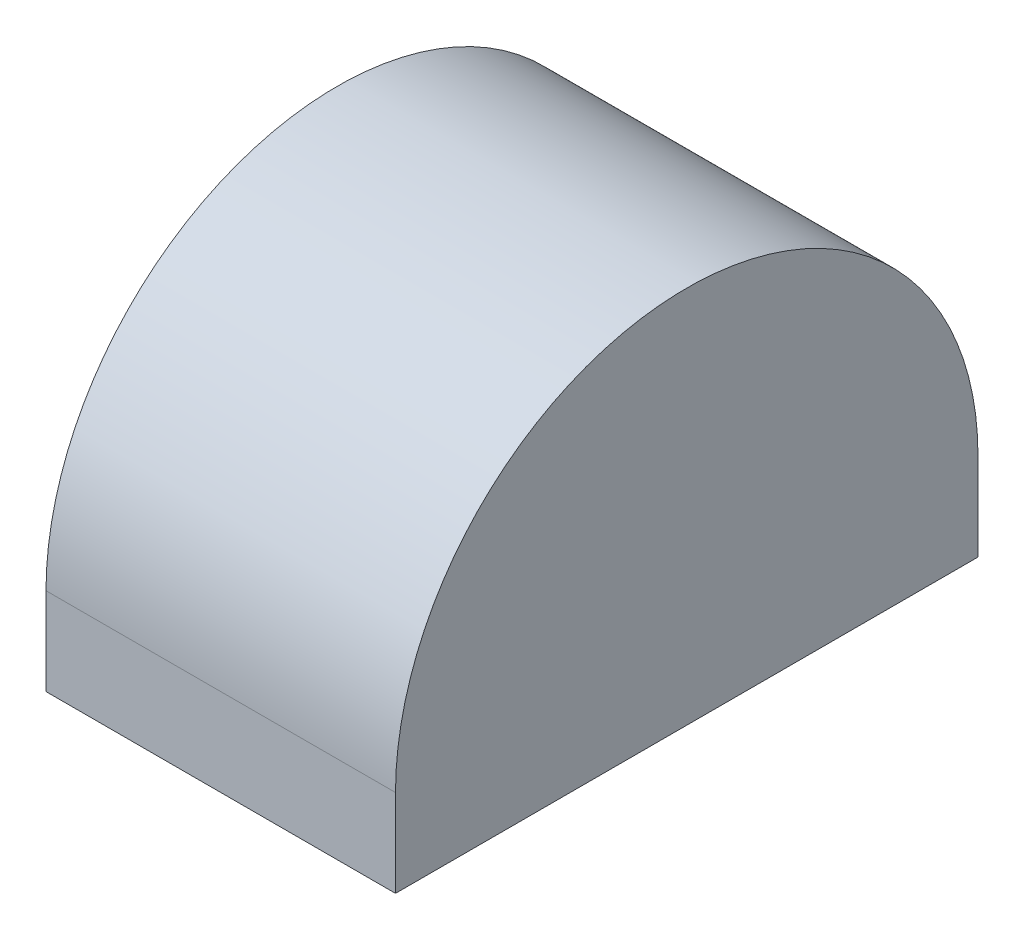
ISO-10303-21;
HEADER;
FILE_DESCRIPTION(('STEP AP214'),'2;1');
FILE_NAME('part.step','',(''),(''),'','','');
FILE_SCHEMA(('AUTOMOTIVE_DESIGN { 1 0 10303 214 1 1 1 1 }'));
ENDSEC;
DATA;
#1=APPLICATION_CONTEXT('core data for automotive mechanical design processes');
#2=APPLICATION_PROTOCOL_DEFINITION('international standard','automotive_design',2000,#1);
#3=PRODUCT_CONTEXT('',#1,'mechanical');
#4=PRODUCT('Part','Part','',(#3));
#5=PRODUCT_RELATED_PRODUCT_CATEGORY('part','',(#4));
#6=PRODUCT_DEFINITION_FORMATION('','',#4);
#7=PRODUCT_DEFINITION_CONTEXT('part definition',#1,'design');
#8=PRODUCT_DEFINITION('design','',#6,#7);
#9=PRODUCT_DEFINITION_SHAPE('','',#8);
#10=(LENGTH_UNIT() NAMED_UNIT(*) SI_UNIT(.MILLI.,.METRE.));
#11=(NAMED_UNIT(*) PLANE_ANGLE_UNIT() SI_UNIT($,.RADIAN.));
#12=(NAMED_UNIT(*) SI_UNIT($,.STERADIAN.) SOLID_ANGLE_UNIT());
#13=UNCERTAINTY_MEASURE_WITH_UNIT(LENGTH_MEASURE(1.E-05),#10,'distance_accuracy_value','');
#14=(GEOMETRIC_REPRESENTATION_CONTEXT(3) GLOBAL_UNCERTAINTY_ASSIGNED_CONTEXT((#13)) GLOBAL_UNIT_ASSIGNED_CONTEXT((#10,
#11,#12)) REPRESENTATION_CONTEXT('',''));
#15=CARTESIAN_POINT('',(0.,0.,0.));
#16=DIRECTION('',(0.,0.,1.));
#17=DIRECTION('',(1.,0.,0.));
#18=AXIS2_PLACEMENT_3D('',#15,#16,#17);
#19=CARTESIAN_POINT('',(6.,0.,0.));
#20=DIRECTION('',(0.,1.,0.));
#21=DIRECTION('',(0.,0.,1.));
#22=AXIS2_PLACEMENT_3D('',#19,#20,#21);
#23=PLANE('',#22);
#24=DIRECTION('',(1.,0.,0.));
#25=VECTOR('',#24,1.);
#26=CARTESIAN_POINT('',(-3.5,0.,-17.5));
#27=LINE('',#26,#25);
#28=CARTESIAN_POINT('',(-3.5,0.,-17.5));
#29=VERTEX_POINT('',#28);
#30=CARTESIAN_POINT('',(3.5,0.,-17.5));
#31=VERTEX_POINT('',#30);
#32=EDGE_CURVE('E140',#29,#31,#27,.T.);
#33=ORIENTED_EDGE('',*,*,#32,.F.);
#34=DIRECTION('',(0.,0.,-1.));
#35=VECTOR('',#34,1.);
#36=CARTESIAN_POINT('',(-3.5,0.,-10.));
#37=LINE('',#36,#35);
#38=CARTESIAN_POINT('',(-3.5,0.,-2.5));
#39=VERTEX_POINT('',#38);
#40=EDGE_CURVE('E125',#39,#29,#37,.T.);
#41=ORIENTED_EDGE('',*,*,#40,.F.);
#42=DIRECTION('',(1.,0.,0.));
#43=VECTOR('',#42,1.);
#44=CARTESIAN_POINT('',(-3.5,0.,-2.5));
#45=LINE('',#44,#43);
#46=CARTESIAN_POINT('',(3.5,0.,-2.5));
#47=VERTEX_POINT('',#46);
#48=EDGE_CURVE('E166',#39,#47,#45,.T.);
#49=ORIENTED_EDGE('',*,*,#48,.T.);
#50=DIRECTION('',(0.,0.,-1.));
#51=VECTOR('',#50,1.);
#52=CARTESIAN_POINT('',(3.5,0.,-10.));
#53=LINE('',#52,#51);
#54=EDGE_CURVE('E147',#47,#31,#53,.T.);
#55=ORIENTED_EDGE('',*,*,#54,.T.);
#56=EDGE_LOOP('',(#33,#41,#49,#55));
#57=FACE_BOUND('',#56,.T.);
#58=DIRECTION('',(0.,0.,-1.));
#59=VECTOR('',#58,1.);
#60=CARTESIAN_POINT('',(-6.,0.,0.));
#61=LINE('',#60,#59);
#62=CARTESIAN_POINT('',(-6.,0.,0.));
#63=VERTEX_POINT('',#62);
#64=CARTESIAN_POINT('',(-6.,0.,-20.));
#65=VERTEX_POINT('',#64);
#66=EDGE_CURVE('E162',#63,#65,#61,.T.);
#67=ORIENTED_EDGE('',*,*,#66,.T.);
#68=DIRECTION('',(-1.,0.,0.));
#69=VECTOR('',#68,1.);
#70=CARTESIAN_POINT('',(6.,0.,-20.));
#71=LINE('',#70,#69);
#72=CARTESIAN_POINT('',(6.,0.,-20.));
#73=VERTEX_POINT('',#72);
#74=EDGE_CURVE('E11',#73,#65,#71,.T.);
#75=ORIENTED_EDGE('',*,*,#74,.F.);
#76=DIRECTION('',(0.,0.,-1.));
#77=VECTOR('',#76,1.);
#78=CARTESIAN_POINT('',(6.,0.,0.));
#79=LINE('',#78,#77);
#80=CARTESIAN_POINT('',(6.,0.,0.));
#81=VERTEX_POINT('',#80);
#82=EDGE_CURVE('E155',#81,#73,#79,.T.);
#83=ORIENTED_EDGE('',*,*,#82,.F.);
#84=DIRECTION('',(-1.,0.,0.));
#85=VECTOR('',#84,1.);
#86=CARTESIAN_POINT('',(6.,0.,0.));
#87=LINE('',#86,#85);
#88=EDGE_CURVE('E161',#81,#63,#87,.T.);
#89=ORIENTED_EDGE('',*,*,#88,.T.);
#90=EDGE_LOOP('',(#67,#75,#83,#89));
#91=FACE_BOUND('',#90,.T.);
#92=ADVANCED_FACE('F32',(#57,#91),#23,.F.);
#93=CARTESIAN_POINT('',(6.,0.,-20.));
#94=DIRECTION('',(0.,0.,1.));
#95=DIRECTION('',(1.,0.,0.));
#96=AXIS2_PLACEMENT_3D('',#93,#94,#95);
#97=PLANE('',#96);
#98=DIRECTION('',(0.,1.,0.));
#99=VECTOR('',#98,1.);
#100=CARTESIAN_POINT('',(-6.,0.,-20.));
#101=LINE('',#100,#99);
#102=CARTESIAN_POINT('',(-6.,3.,-20.));
#103=VERTEX_POINT('',#102);
#104=EDGE_CURVE('E165',#65,#103,#101,.T.);
#105=ORIENTED_EDGE('',*,*,#104,.T.);
#106=DIRECTION('',(-1.,0.,0.));
#107=VECTOR('',#106,1.);
#108=CARTESIAN_POINT('',(6.,3.,-20.));
#109=LINE('',#108,#107);
#110=CARTESIAN_POINT('',(6.,3.,-20.));
#111=VERTEX_POINT('',#110);
#112=EDGE_CURVE('E39',#111,#103,#109,.T.);
#113=ORIENTED_EDGE('',*,*,#112,.F.);
#114=DIRECTION('',(0.,1.,0.));
#115=VECTOR('',#114,1.);
#116=CARTESIAN_POINT('',(6.,0.,-20.));
#117=LINE('',#116,#115);
#118=EDGE_CURVE('E83',#73,#111,#117,.T.);
#119=ORIENTED_EDGE('',*,*,#118,.F.);
#120=ORIENTED_EDGE('',*,*,#74,.T.);
#121=EDGE_LOOP('',(#105,#113,#119,#120));
#122=FACE_BOUND('',#121,.T.);
#123=ADVANCED_FACE('F193',(#122),#97,.F.);
#124=CARTESIAN_POINT('',(6.,3.,-10.));
#125=DIRECTION('',(-1.,0.,0.));
#126=DIRECTION('',(0.,0.,1.));
#127=AXIS2_PLACEMENT_3D('',#124,#125,#126);
#128=CYLINDRICAL_SURFACE('',#127,10.);
#129=CARTESIAN_POINT('',(-6.,3.,-10.));
#130=DIRECTION('',(1.,0.,0.));
#131=DIRECTION('',(0.,0.,1.));
#132=AXIS2_PLACEMENT_3D('',#129,#130,#131);
#133=CIRCLE('',#132,10.);
#134=CARTESIAN_POINT('',(-6.,3.,0.));
#135=VERTEX_POINT('',#134);
#136=EDGE_CURVE('E168',#103,#135,#133,.T.);
#137=ORIENTED_EDGE('',*,*,#136,.T.);
#138=DIRECTION('',(-1.,0.,0.));
#139=VECTOR('',#138,1.);
#140=CARTESIAN_POINT('',(6.,3.,0.));
#141=LINE('',#140,#139);
#142=CARTESIAN_POINT('',(6.,3.,0.));
#143=VERTEX_POINT('',#142);
#144=EDGE_CURVE('E172',#143,#135,#141,.T.);
#145=ORIENTED_EDGE('',*,*,#144,.F.);
#146=CARTESIAN_POINT('',(6.,3.,-10.));
#147=DIRECTION('',(1.,0.,0.));
#148=DIRECTION('',(0.,0.,1.));
#149=AXIS2_PLACEMENT_3D('',#146,#147,#148);
#150=CIRCLE('',#149,10.);
#151=EDGE_CURVE('E158',#111,#143,#150,.T.);
#152=ORIENTED_EDGE('',*,*,#151,.F.);
#153=ORIENTED_EDGE('',*,*,#112,.T.);
#154=EDGE_LOOP('',(#137,#145,#152,#153));
#155=FACE_BOUND('',#154,.T.);
#156=ADVANCED_FACE('F177',(#155),#128,.T.);
#157=CARTESIAN_POINT('',(6.,0.,0.));
#158=DIRECTION('',(0.,0.,-1.));
#159=DIRECTION('',(-1.,0.,0.));
#160=AXIS2_PLACEMENT_3D('',#157,#158,#159);
#161=PLANE('',#160);
#162=DIRECTION('',(0.,-1.,0.));
#163=VECTOR('',#162,1.);
#164=CARTESIAN_POINT('',(-6.,0.,0.));
#165=LINE('',#164,#163);
#166=EDGE_CURVE('E76',#135,#63,#165,.T.);
#167=ORIENTED_EDGE('',*,*,#166,.T.);
#168=ORIENTED_EDGE('',*,*,#88,.F.);
#169=DIRECTION('',(0.,-1.,0.));
#170=VECTOR('',#169,1.);
#171=CARTESIAN_POINT('',(6.,0.,0.));
#172=LINE('',#171,#170);
#173=EDGE_CURVE('E55',#143,#81,#172,.T.);
#174=ORIENTED_EDGE('',*,*,#173,.F.);
#175=ORIENTED_EDGE('',*,*,#144,.T.);
#176=EDGE_LOOP('',(#167,#168,#174,#175));
#177=FACE_BOUND('',#176,.T.);
#178=ADVANCED_FACE('F184',(#177),#161,.F.);
#179=CARTESIAN_POINT('',(6.,3.,-10.));
#180=DIRECTION('',(-1.,0.,0.));
#181=DIRECTION('',(0.,0.,1.));
#182=AXIS2_PLACEMENT_3D('',#179,#180,#181);
#183=PLANE('',#182);
#184=ORIENTED_EDGE('',*,*,#82,.T.);
#185=ORIENTED_EDGE('',*,*,#118,.T.);
#186=ORIENTED_EDGE('',*,*,#151,.T.);
#187=ORIENTED_EDGE('',*,*,#173,.T.);
#188=EDGE_LOOP('',(#184,#185,#186,#187));
#189=FACE_BOUND('',#188,.T.);
#190=ADVANCED_FACE('F186',(#189),#183,.F.);
#191=CARTESIAN_POINT('',(-6.,3.,-10.));
#192=DIRECTION('',(-1.,0.,0.));
#193=DIRECTION('',(0.,0.,1.));
#194=AXIS2_PLACEMENT_3D('',#191,#192,#193);
#195=PLANE('',#194);
#196=ORIENTED_EDGE('',*,*,#66,.F.);
#197=ORIENTED_EDGE('',*,*,#166,.F.);
#198=ORIENTED_EDGE('',*,*,#136,.F.);
#199=ORIENTED_EDGE('',*,*,#104,.F.);
#200=EDGE_LOOP('',(#196,#197,#198,#199));
#201=FACE_BOUND('',#200,.T.);
#202=ADVANCED_FACE('F181',(#201),#195,.T.);
#203=CARTESIAN_POINT('',(-3.5,0.,-2.5));
#204=DIRECTION('',(0.,0.,1.));
#205=DIRECTION('',(0.,-1.,0.));
#206=AXIS2_PLACEMENT_3D('',#203,#204,#205);
#207=PLANE('',#206);
#208=DIRECTION('',(0.,-1.,0.));
#209=VECTOR('',#208,1.);
#210=CARTESIAN_POINT('',(3.5,0.,-2.5));
#211=LINE('',#210,#209);
#212=CARTESIAN_POINT('',(3.5,3.,-2.5));
#213=VERTEX_POINT('',#212);
#214=EDGE_CURVE('E136',#213,#47,#211,.T.);
#215=ORIENTED_EDGE('',*,*,#214,.T.);
#216=ORIENTED_EDGE('',*,*,#48,.F.);
#217=DIRECTION('',(0.,-1.,0.));
#218=VECTOR('',#217,1.);
#219=CARTESIAN_POINT('',(-3.5,0.,-2.5));
#220=LINE('',#219,#218);
#221=CARTESIAN_POINT('',(-3.5,3.,-2.5));
#222=VERTEX_POINT('',#221);
#223=EDGE_CURVE('E132',#222,#39,#220,.T.);
#224=ORIENTED_EDGE('',*,*,#223,.F.);
#225=DIRECTION('',(1.,0.,0.));
#226=VECTOR('',#225,1.);
#227=CARTESIAN_POINT('',(-3.5,3.,-2.5));
#228=LINE('',#227,#226);
#229=EDGE_CURVE('E319',#222,#213,#228,.T.);
#230=ORIENTED_EDGE('',*,*,#229,.T.);
#231=EDGE_LOOP('',(#215,#216,#224,#230));
#232=FACE_BOUND('',#231,.T.);
#233=ADVANCED_FACE('F224',(#232),#207,.F.);
#234=CARTESIAN_POINT('',(-3.5,3.,-9.72243186433541));
#235=DIRECTION('',(1.,0.,0.));
#236=DIRECTION('',(0.,0.,-1.));
#237=AXIS2_PLACEMENT_3D('',#234,#235,#236);
#238=CYLINDRICAL_SURFACE('',#237,7.22243186433542);
#239=CARTESIAN_POINT('',(3.5,3.,-9.72243186433541));
#240=DIRECTION('',(1.,0.,0.));
#241=DIRECTION('',(0.,0.,1.));
#242=AXIS2_PLACEMENT_3D('',#239,#240,#241);
#243=CIRCLE('',#242,7.22243186433542);
#244=CARTESIAN_POINT('',(3.5,9.25480947161666,-6.11121593216767));
#245=VERTEX_POINT('',#244);
#246=EDGE_CURVE('E311',#245,#213,#243,.T.);
#247=ORIENTED_EDGE('',*,*,#246,.T.);
#248=ORIENTED_EDGE('',*,*,#229,.F.);
#249=CARTESIAN_POINT('',(-3.5,3.,-9.72243186433541));
#250=DIRECTION('',(1.,0.,0.));
#251=DIRECTION('',(0.,0.,1.));
#252=AXIS2_PLACEMENT_3D('',#249,#250,#251);
#253=CIRCLE('',#252,7.22243186433542);
#254=CARTESIAN_POINT('',(-3.5,9.25480947161666,-6.11121593216767));
#255=VERTEX_POINT('',#254);
#256=EDGE_CURVE('E151',#255,#222,#253,.T.);
#257=ORIENTED_EDGE('',*,*,#256,.F.);
#258=DIRECTION('',(1.,0.,0.));
#259=VECTOR('',#258,1.);
#260=CARTESIAN_POINT('',(-3.5,9.25480947161666,-6.11121593216767));
#261=LINE('',#260,#259);
#262=EDGE_CURVE('E321',#255,#245,#261,.T.);
#263=ORIENTED_EDGE('',*,*,#262,.T.);
#264=EDGE_LOOP('',(#247,#248,#257,#263));
#265=FACE_BOUND('',#264,.T.);
#266=ADVANCED_FACE('F237',(#265),#238,.F.);
#267=CARTESIAN_POINT('',(-3.5,11.5,-10.));
#268=DIRECTION('',(0.,0.866025403784436,0.500000000000004));
#269=DIRECTION('',(0.,-0.500000000000004,0.866025403784436));
#270=AXIS2_PLACEMENT_3D('',#267,#268,#269);
#271=PLANE('',#270);
#272=DIRECTION('',(0.,-0.500000000000004,0.866025403784436));
#273=VECTOR('',#272,1.);
#274=CARTESIAN_POINT('',(3.5,11.5,-10.));
#275=LINE('',#274,#273);
#276=CARTESIAN_POINT('',(3.5,11.5,-10.));
#277=VERTEX_POINT('',#276);
#278=EDGE_CURVE('E314',#277,#245,#275,.T.);
#279=ORIENTED_EDGE('',*,*,#278,.T.);
#280=ORIENTED_EDGE('',*,*,#262,.F.);
#281=DIRECTION('',(0.,-0.500000000000004,0.866025403784436));
#282=VECTOR('',#281,1.);
#283=CARTESIAN_POINT('',(-3.5,11.5,-10.));
#284=LINE('',#283,#282);
#285=CARTESIAN_POINT('',(-3.5,11.5,-10.));
#286=VERTEX_POINT('',#285);
#287=EDGE_CURVE('E339',#286,#255,#284,.T.);
#288=ORIENTED_EDGE('',*,*,#287,.F.);
#289=DIRECTION('',(1.,0.,0.));
#290=VECTOR('',#289,1.);
#291=CARTESIAN_POINT('',(-3.5,11.5,-10.));
#292=LINE('',#291,#290);
#293=EDGE_CURVE('E323',#286,#277,#292,.T.);
#294=ORIENTED_EDGE('',*,*,#293,.T.);
#295=EDGE_LOOP('',(#279,#280,#288,#294));
#296=FACE_BOUND('',#295,.T.);
#297=ADVANCED_FACE('F247',(#296),#271,.F.);
#298=CARTESIAN_POINT('',(-3.5,11.5,-10.));
#299=DIRECTION('',(0.,0.866025403784436,-0.500000000000004));
#300=DIRECTION('',(0.,0.500000000000004,0.866025403784436));
#301=AXIS2_PLACEMENT_3D('',#298,#299,#300);
#302=PLANE('',#301);
#303=DIRECTION('',(0.,0.500000000000004,0.866025403784436));
#304=VECTOR('',#303,1.);
#305=CARTESIAN_POINT('',(3.5,11.5,-10.));
#306=LINE('',#305,#304);
#307=CARTESIAN_POINT('',(3.5,9.25480947161666,-13.8887840678323));
#308=VERTEX_POINT('',#307);
#309=EDGE_CURVE('E327',#308,#277,#306,.T.);
#310=ORIENTED_EDGE('',*,*,#309,.T.);
#311=ORIENTED_EDGE('',*,*,#293,.F.);
#312=DIRECTION('',(0.,0.500000000000004,0.866025403784436));
#313=VECTOR('',#312,1.);
#314=CARTESIAN_POINT('',(-3.5,11.5,-10.));
#315=LINE('',#314,#313);
#316=CARTESIAN_POINT('',(-3.5,9.25480947161666,-13.8887840678323));
#317=VERTEX_POINT('',#316);
#318=EDGE_CURVE('E329',#317,#286,#315,.T.);
#319=ORIENTED_EDGE('',*,*,#318,.F.);
#320=DIRECTION('',(1.,0.,0.));
#321=VECTOR('',#320,1.);
#322=CARTESIAN_POINT('',(-3.5,9.25480947161666,-13.8887840678323));
#323=LINE('',#322,#321);
#324=EDGE_CURVE('E149',#317,#308,#323,.T.);
#325=ORIENTED_EDGE('',*,*,#324,.T.);
#326=EDGE_LOOP('',(#310,#311,#319,#325));
#327=FACE_BOUND('',#326,.T.);
#328=ADVANCED_FACE('F257',(#327),#302,.F.);
#329=CARTESIAN_POINT('',(-3.5,3.,-10.2775681356646));
#330=DIRECTION('',(1.,0.,0.));
#331=DIRECTION('',(0.,0.,-1.));
#332=AXIS2_PLACEMENT_3D('',#329,#330,#331);
#333=CYLINDRICAL_SURFACE('',#332,7.22243186433542);
#334=CARTESIAN_POINT('',(3.5,3.,-10.2775681356646));
#335=DIRECTION('',(1.,0.,0.));
#336=DIRECTION('',(0.,0.,1.));
#337=AXIS2_PLACEMENT_3D('',#334,#335,#336);
#338=CIRCLE('',#337,7.22243186433542);
#339=CARTESIAN_POINT('',(3.5,3.,-17.5));
#340=VERTEX_POINT('',#339);
#341=EDGE_CURVE('E331',#340,#308,#338,.T.);
#342=ORIENTED_EDGE('',*,*,#341,.T.);
#343=ORIENTED_EDGE('',*,*,#324,.F.);
#344=CARTESIAN_POINT('',(-3.5,3.,-10.2775681356646));
#345=DIRECTION('',(1.,0.,0.));
#346=DIRECTION('',(0.,0.,1.));
#347=AXIS2_PLACEMENT_3D('',#344,#345,#346);
#348=CIRCLE('',#347,7.22243186433542);
#349=CARTESIAN_POINT('',(-3.5,3.,-17.5));
#350=VERTEX_POINT('',#349);
#351=EDGE_CURVE('E144',#350,#317,#348,.T.);
#352=ORIENTED_EDGE('',*,*,#351,.F.);
#353=DIRECTION('',(1.,0.,0.));
#354=VECTOR('',#353,1.);
#355=CARTESIAN_POINT('',(-3.5,3.,-17.5));
#356=LINE('',#355,#354);
#357=EDGE_CURVE('E142',#350,#340,#356,.T.);
#358=ORIENTED_EDGE('',*,*,#357,.T.);
#359=EDGE_LOOP('',(#342,#343,#352,#358));
#360=FACE_BOUND('',#359,.T.);
#361=ADVANCED_FACE('F267',(#360),#333,.F.);
#362=CARTESIAN_POINT('',(-3.5,0.,-17.5));
#363=DIRECTION('',(0.,0.,-1.));
#364=DIRECTION('',(-1.,0.,0.));
#365=AXIS2_PLACEMENT_3D('',#362,#363,#364);
#366=PLANE('',#365);
#367=DIRECTION('',(0.,1.,0.));
#368=VECTOR('',#367,1.);
#369=CARTESIAN_POINT('',(3.5,0.,-17.5));
#370=LINE('',#369,#368);
#371=EDGE_CURVE('E46',#31,#340,#370,.T.);
#372=ORIENTED_EDGE('',*,*,#371,.T.);
#373=ORIENTED_EDGE('',*,*,#357,.F.);
#374=DIRECTION('',(0.,1.,0.));
#375=VECTOR('',#374,1.);
#376=CARTESIAN_POINT('',(-3.5,0.,-17.5));
#377=LINE('',#376,#375);
#378=EDGE_CURVE('E129',#29,#350,#377,.T.);
#379=ORIENTED_EDGE('',*,*,#378,.F.);
#380=ORIENTED_EDGE('',*,*,#32,.T.);
#381=EDGE_LOOP('',(#372,#373,#379,#380));
#382=FACE_BOUND('',#381,.T.);
#383=ADVANCED_FACE('F139',(#382),#366,.F.);
#384=CARTESIAN_POINT('',(-3.5,3.,-9.72243186433541));
#385=DIRECTION('',(-1.,0.,0.));
#386=DIRECTION('',(0.,0.,1.));
#387=AXIS2_PLACEMENT_3D('',#384,#385,#386);
#388=PLANE('',#387);
#389=ORIENTED_EDGE('',*,*,#40,.T.);
#390=ORIENTED_EDGE('',*,*,#378,.T.);
#391=ORIENTED_EDGE('',*,*,#351,.T.);
#392=ORIENTED_EDGE('',*,*,#318,.T.);
#393=ORIENTED_EDGE('',*,*,#287,.T.);
#394=ORIENTED_EDGE('',*,*,#256,.T.);
#395=ORIENTED_EDGE('',*,*,#223,.T.);
#396=EDGE_LOOP('',(#389,#390,#391,#392,#393,#394,#395));
#397=FACE_BOUND('',#396,.T.);
#398=ADVANCED_FACE('F127',(#397),#388,.F.);
#399=CARTESIAN_POINT('',(3.5,3.,-9.72243186433541));
#400=DIRECTION('',(-1.,0.,0.));
#401=DIRECTION('',(0.,0.,1.));
#402=AXIS2_PLACEMENT_3D('',#399,#400,#401);
#403=PLANE('',#402);
#404=ORIENTED_EDGE('',*,*,#214,.F.);
#405=ORIENTED_EDGE('',*,*,#246,.F.);
#406=ORIENTED_EDGE('',*,*,#278,.F.);
#407=ORIENTED_EDGE('',*,*,#309,.F.);
#408=ORIENTED_EDGE('',*,*,#341,.F.);
#409=ORIENTED_EDGE('',*,*,#371,.F.);
#410=ORIENTED_EDGE('',*,*,#54,.F.);
#411=EDGE_LOOP('',(#404,#405,#406,#407,#408,#409,#410));
#412=FACE_BOUND('',#411,.T.);
#413=ADVANCED_FACE('F294',(#412),#403,.T.);
#414=CLOSED_SHELL('',(#92,#123,#156,#178,#190,#202,#233,#266,#297,#328,#361,#383,#398,#413));
#415=MANIFOLD_SOLID_BREP('B2',#414);
#416=ADVANCED_BREP_SHAPE_REPRESENTATION('',(#18,#415),#14);
#417=SHAPE_DEFINITION_REPRESENTATION(#9,#416);
ENDSEC;
END-ISO-10303-21;
